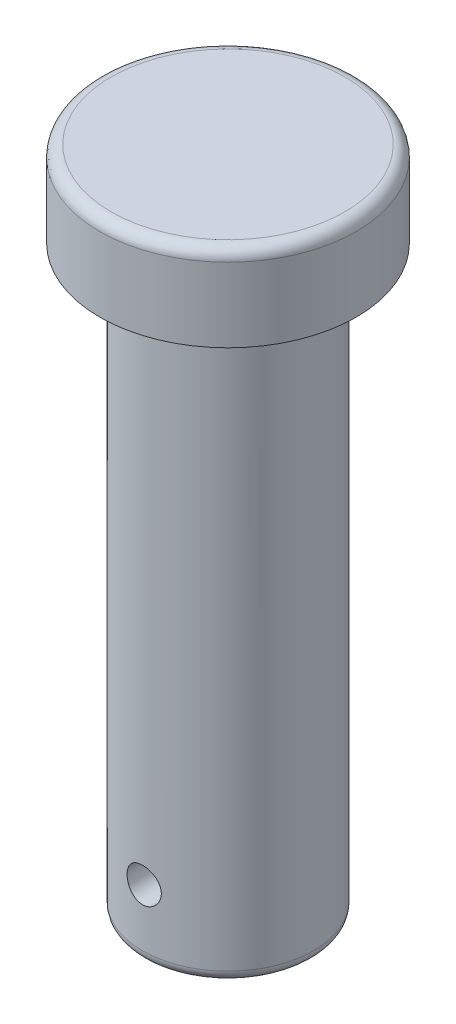
ISO-10303-21;
HEADER;
FILE_DESCRIPTION(('STEP AP214'),'2;1');
FILE_NAME('part.step','',(''),(''),'','','');
FILE_SCHEMA(('AUTOMOTIVE_DESIGN { 1 0 10303 214 1 1 1 1 }'));
ENDSEC;
DATA;
#1=APPLICATION_CONTEXT('core data for automotive mechanical design processes');
#2=APPLICATION_PROTOCOL_DEFINITION('international standard','automotive_design',2000,#1);
#3=PRODUCT_CONTEXT('',#1,'mechanical');
#4=PRODUCT('Part','Part','',(#3));
#5=PRODUCT_RELATED_PRODUCT_CATEGORY('part','',(#4));
#6=PRODUCT_DEFINITION_FORMATION('','',#4);
#7=PRODUCT_DEFINITION_CONTEXT('part definition',#1,'design');
#8=PRODUCT_DEFINITION('design','',#6,#7);
#9=PRODUCT_DEFINITION_SHAPE('','',#8);
#10=(LENGTH_UNIT() NAMED_UNIT(*) SI_UNIT(.MILLI.,.METRE.));
#11=(NAMED_UNIT(*) PLANE_ANGLE_UNIT() SI_UNIT($,.RADIAN.));
#12=(NAMED_UNIT(*) SI_UNIT($,.STERADIAN.) SOLID_ANGLE_UNIT());
#13=UNCERTAINTY_MEASURE_WITH_UNIT(LENGTH_MEASURE(1.E-05),#10,'distance_accuracy_value','');
#14=(GEOMETRIC_REPRESENTATION_CONTEXT(3) GLOBAL_UNCERTAINTY_ASSIGNED_CONTEXT((#13)) GLOBAL_UNIT_ASSIGNED_CONTEXT((#10,
#11,#12)) REPRESENTATION_CONTEXT('',''));
#15=CARTESIAN_POINT('',(0.,0.,0.));
#16=DIRECTION('',(0.,0.,1.));
#17=DIRECTION('',(1.,0.,0.));
#18=AXIS2_PLACEMENT_3D('',#15,#16,#17);
#19=CARTESIAN_POINT('',(0.,15.,0.));
#20=DIRECTION('',(0.,-1.,0.));
#21=DIRECTION('',(0.,0.,-1.));
#22=AXIS2_PLACEMENT_3D('',#19,#20,#21);
#23=CYLINDRICAL_SURFACE('',#22,22.5);
#24=CARTESIAN_POINT('',(0.,13.,0.));
#25=DIRECTION('',(0.,1.,0.));
#26=DIRECTION('',(0.,0.,1.));
#27=AXIS2_PLACEMENT_3D('',#24,#25,#26);
#28=CIRCLE('',#27,22.5);
#29=CARTESIAN_POINT('',(0.,13.,22.5));
#30=VERTEX_POINT('',#29);
#31=EDGE_CURVE('E46',#30,#30,#28,.F.);
#32=ORIENTED_EDGE('',*,*,#31,.T.);
#33=EDGE_LOOP('',(#32));
#34=FACE_BOUND('',#33,.T.);
#35=CARTESIAN_POINT('',(0.,0.,0.));
#36=DIRECTION('',(0.,1.,0.));
#37=DIRECTION('',(0.,0.,1.));
#38=AXIS2_PLACEMENT_3D('',#35,#36,#37);
#39=CIRCLE('',#38,22.5);
#40=CARTESIAN_POINT('',(0.,0.,22.5));
#41=VERTEX_POINT('',#40);
#42=EDGE_CURVE('E111',#41,#41,#39,.T.);
#43=ORIENTED_EDGE('',*,*,#42,.T.);
#44=EDGE_LOOP('',(#43));
#45=FACE_BOUND('',#44,.T.);
#46=ADVANCED_FACE('F33',(#34,#45),#23,.T.);
#47=CARTESIAN_POINT('',(0.,15.,0.));
#48=DIRECTION('',(0.,1.,0.));
#49=DIRECTION('',(0.,0.,1.));
#50=AXIS2_PLACEMENT_3D('',#47,#48,#49);
#51=PLANE('',#50);
#52=CARTESIAN_POINT('',(0.,15.,0.));
#53=DIRECTION('',(0.,1.,0.));
#54=DIRECTION('',(0.,0.,1.));
#55=AXIS2_PLACEMENT_3D('',#52,#53,#54);
#56=CIRCLE('',#55,20.5);
#57=CARTESIAN_POINT('',(0.,15.,20.5));
#58=VERTEX_POINT('',#57);
#59=EDGE_CURVE('E51',#58,#58,#56,.T.);
#60=ORIENTED_EDGE('',*,*,#59,.T.);
#61=EDGE_LOOP('',(#60));
#62=FACE_BOUND('',#61,.T.);
#63=ADVANCED_FACE('F83',(#62),#51,.T.);
#64=CARTESIAN_POINT('',(0.,0.,0.));
#65=DIRECTION('',(0.,1.,0.));
#66=DIRECTION('',(0.,0.,1.));
#67=AXIS2_PLACEMENT_3D('',#64,#65,#66);
#68=PLANE('',#67);
#69=CARTESIAN_POINT('',(0.,0.,0.));
#70=DIRECTION('',(0.,1.,0.));
#71=DIRECTION('',(0.,0.,1.));
#72=AXIS2_PLACEMENT_3D('',#69,#70,#71);
#73=CIRCLE('',#72,17.);
#74=CARTESIAN_POINT('',(0.,0.,17.));
#75=VERTEX_POINT('',#74);
#76=EDGE_CURVE('E10',#75,#75,#73,.T.);
#77=ORIENTED_EDGE('',*,*,#76,.T.);
#78=EDGE_LOOP('',(#77));
#79=FACE_BOUND('',#78,.T.);
#80=ORIENTED_EDGE('',*,*,#42,.F.);
#81=EDGE_LOOP('',(#80));
#82=FACE_BOUND('',#81,.T.);
#83=ADVANCED_FACE('F79',(#79,#82),#68,.F.);
#84=CARTESIAN_POINT('',(0.,-102.,0.));
#85=DIRECTION('',(0.,1.,0.));
#86=DIRECTION('',(0.,0.,1.));
#87=AXIS2_PLACEMENT_3D('',#84,#85,#86);
#88=CYLINDRICAL_SURFACE('',#87,15.);
#89=CARTESIAN_POINT('',(0.,-93.,15.));
#90=CARTESIAN_POINT('',(-0.1667307203779,-92.999993866505,14.9999969274261));
#91=CARTESIAN_POINT('',(-0.333538980604568,-92.9860534710971,14.9971915553469));
#92=CARTESIAN_POINT('',(-0.66244052306706,-92.9307044996543,14.9862709686969));
#93=CARTESIAN_POINT('',(-0.824529952624069,-92.8892741015955,14.9781515358056));
#94=CARTESIAN_POINT('',(-1.13919091578994,-92.7802761791376,14.9575094783486));
#95=CARTESIAN_POINT('',(-1.2917714037994,-92.7127336894659,14.9449910723015));
#96=CARTESIAN_POINT('',(-1.58342396659268,-92.5535032574661,14.9169119410594));
#97=CARTESIAN_POINT('',(-1.72249684522744,-92.4618167531784,14.9013513970712));
#98=CARTESIAN_POINT('',(-1.9850804319446,-92.2555845171257,14.8686649598991));
#99=CARTESIAN_POINT('',(-2.10838185347557,-92.1407749338264,14.8515223651304));
#100=CARTESIAN_POINT('',(-2.33411026982408,-91.8921227508249,14.8177254135776));
#101=CARTESIAN_POINT('',(-2.43653563431127,-91.7582786659947,14.8010710950127));
#102=CARTESIAN_POINT('',(-2.61849526004286,-91.4738514209644,14.7699732543785));
#103=CARTESIAN_POINT('',(-2.6978128165976,-91.3231270686109,14.7555512209484));
#104=CARTESIAN_POINT('',(-2.82991699974093,-91.0101545429878,14.7307880417525));
#105=CARTESIAN_POINT('',(-2.88270624731171,-90.8479075099609,14.7204464928588));
#106=CARTESIAN_POINT('',(-2.95957589965448,-90.5187469082762,14.7051841575661));
#107=CARTESIAN_POINT('',(-2.98402349387633,-90.3519223675733,14.7001941032156));
#108=CARTESIAN_POINT('',(-3.00465638317836,-90.016470535907,14.6959912518188));
#109=CARTESIAN_POINT('',(-3.0008445681405,-89.8478434310396,14.6967778640352));
#110=CARTESIAN_POINT('',(-2.96536371930546,-89.516259635937,14.7039765344455));
#111=CARTESIAN_POINT('',(-2.93411562073172,-89.3532557831181,14.7103035857629));
#112=CARTESIAN_POINT('',(-2.84531365386916,-89.034851770011,14.7277363848));
#113=CARTESIAN_POINT('',(-2.78775852930205,-88.879451973243,14.7388423607334));
#114=CARTESIAN_POINT('',(-2.64757435102416,-88.5794542148892,14.7646685550122));
#115=CARTESIAN_POINT('',(-2.56477845369635,-88.4349363612925,14.7794126944111));
#116=CARTESIAN_POINT('',(-2.37658072371804,-88.1616874500816,14.8108385631919));
#117=CARTESIAN_POINT('',(-2.27117629307049,-88.0329582094465,14.827520515151));
#118=CARTESIAN_POINT('',(-2.03849980368176,-87.7925117926292,14.8613106372439));
#119=CARTESIAN_POINT('',(-1.91086848363734,-87.6811422964226,14.8784210763271));
#120=CARTESIAN_POINT('',(-1.63855507218603,-87.4813384610963,14.9108654614323));
#121=CARTESIAN_POINT('',(-1.49387276213816,-87.3929044161193,14.9261993846692));
#122=CARTESIAN_POINT('',(-1.19117816063676,-87.2414174723221,14.9534007048266));
#123=CARTESIAN_POINT('',(-1.0331454587559,-87.1784043190664,14.9652626654482));
#124=CARTESIAN_POINT('',(-0.708446929345994,-87.0799185778843,14.9841422696357));
#125=CARTESIAN_POINT('',(-0.541782150217348,-87.0444426537791,14.9911605000159));
#126=CARTESIAN_POINT('',(-0.20753821688145,-87.0025306386172,14.999480156006));
#127=CARTESIAN_POINT('',(-0.0400209849767272,-86.9956187413792,15.0008752395741));
#128=CARTESIAN_POINT('',(0.293774802578145,-87.0097495768265,14.9980515579031));
#129=CARTESIAN_POINT('',(0.460053427331383,-87.0307907380578,14.9938331082434));
#130=CARTESIAN_POINT('',(0.785116979839625,-87.0998351206319,14.9803149602405));
#131=CARTESIAN_POINT('',(0.94395584501971,-87.1475942054937,14.9710612921262));
#132=CARTESIAN_POINT('',(1.251370882499,-87.2684519479674,14.948506561831));
#133=CARTESIAN_POINT('',(1.39994628491262,-87.3415525040305,14.9352051964268));
#134=CARTESIAN_POINT('',(1.68462352105866,-87.5120474719539,14.9057973459988));
#135=CARTESIAN_POINT('',(1.82055038025656,-87.6097283431168,14.8896585131116));
#136=CARTESIAN_POINT('',(2.07425405735762,-87.8262275736218,14.8564420448965));
#137=CARTESIAN_POINT('',(2.19202892679229,-87.9450481991996,14.8393643090516));
#138=CARTESIAN_POINT('',(2.40792177232253,-88.2026200556734,14.8058791067089));
#139=CARTESIAN_POINT('',(2.50571310734597,-88.341647232664,14.7894858069991));
#140=CARTESIAN_POINT('',(2.67655626015362,-88.63443408407,14.7595257538858));
#141=CARTESIAN_POINT('',(2.74960906776871,-88.7881931687207,14.7459588874003));
#142=CARTESIAN_POINT('',(2.86845552474589,-89.1053047384487,14.7233022175315));
#143=CARTESIAN_POINT('',(2.91439049937316,-89.268602523631,14.7141892461656));
#144=CARTESIAN_POINT('',(2.97812595488159,-89.6008003604727,14.7014231037608));
#145=CARTESIAN_POINT('',(2.99593010467534,-89.7696996786281,14.6977692207333));
#146=CARTESIAN_POINT('',(3.00276273260241,-90.105026593633,14.6963744889414));
#147=CARTESIAN_POINT('',(2.99230736421269,-90.271443446781,14.698527575679));
#148=CARTESIAN_POINT('',(2.94405691230018,-90.6000949497151,14.7082672045384));
#149=CARTESIAN_POINT('',(2.90626204838789,-90.7623296330844,14.7158537030151));
#150=CARTESIAN_POINT('',(2.80463570549686,-91.0776831337216,14.7355579265748));
#151=CARTESIAN_POINT('',(2.74086752015203,-91.2308230815073,14.7476646305649));
#152=CARTESIAN_POINT('',(2.58916393380481,-91.5243111622033,14.7750514492251));
#153=CARTESIAN_POINT('',(2.50122650632465,-91.6646582211754,14.7903318299668));
#154=CARTESIAN_POINT('',(2.30191774435925,-91.9311467164509,14.8226688156968));
#155=CARTESIAN_POINT('',(2.19017366170555,-92.0570062958028,14.839751187291));
#156=CARTESIAN_POINT('',(1.94719310703942,-92.2883586165875,14.8735824561586));
#157=CARTESIAN_POINT('',(1.81595216146,-92.3938466709518,14.8903312758955));
#158=CARTESIAN_POINT('',(1.53605288726473,-92.5825039318393,14.9218149716391));
#159=CARTESIAN_POINT('',(1.3872266532895,-92.6654280098401,14.9365269365774));
#160=CARTESIAN_POINT('',(1.0774990828222,-92.8049583677898,14.96205375255));
#161=CARTESIAN_POINT('',(0.91660878258938,-92.8615883685975,14.9728721141585));
#162=CARTESIAN_POINT('',(0.629464466771342,-92.9359558441341,14.9872911778611));
#163=CARTESIAN_POINT('',(0.504844992041359,-92.9599295811233,14.9920290947536));
#164=CARTESIAN_POINT('',(0.253498575630205,-92.9919537370751,14.9983846241968));
#165=CARTESIAN_POINT('',(0.126771701245859,-93.0000046635293,15.0000023361946));
#166=CARTESIAN_POINT('',(0.,-93.,15.));
#167=B_SPLINE_CURVE_WITH_KNOTS('',3,(#89,#90,#91,#92,#93,#94,#95,#96,#97,#98,#99,#100,#101,#102,
#103,#104,#105,#106,#107,#108,#109,#110,#111,#112,#113,#114,#115,#116,#117,#118,#119,#120,#121,
#122,#123,#124,#125,#126,#127,#128,#129,#130,#131,#132,#133,#134,#135,#136,#137,#138,#139,#140,
#141,#142,#143,#144,#145,#146,#147,#148,#149,#150,#151,#152,#153,#154,#155,#156,#157,#158,#159,
#160,#161,#162,#163,#164,#165,#166),.UNSPECIFIED.,.T.,.F.,(4,2,2,2,2,2,2,2,2,2,2,2,2,2,2,2,2,2,
2,2,2,2,2,2,2,2,2,2,2,2,2,2,2,2,2,2,2,2,4),(0.,0.499728391983777,0.999853952073972,
1.49950120575102,1.9991187066926,2.50479801033655,3.0105167902421,3.52083585017769,
4.03110448095593,4.53468555310762,5.03821512843675,5.53415181018835,6.0301121776119,
6.52942470610777,7.02879464249011,7.53714757474053,8.04550702619462,8.55465824562072,
9.06374777094109,9.56432207028796,10.064868229736,10.5609136185217,11.0569961764807,
11.5591519810008,12.0613616503779,12.5712188573768,13.081055661704,13.5882114309817,
14.0953010499125,14.5931916770311,15.0910783047783,15.5877588375933,16.084481027456,
16.5896422871743,17.0949196359879,17.6054849002691,18.1155886655256,18.4955632586968,
18.8755257411299),.UNSPECIFIED.);
#168=CARTESIAN_POINT('',(0.,-93.,15.));
#169=VERTEX_POINT('',#168);
#170=EDGE_CURVE('E37',#169,#169,#167,.T.);
#171=ORIENTED_EDGE('',*,*,#170,.T.);
#172=EDGE_LOOP('',(#171));
#173=FACE_BOUND('',#172,.T.);
#174=CARTESIAN_POINT('',(3.,-90.,-14.6969384566991));
#175=CARTESIAN_POINT('',(2.99999383762582,-89.8333068735265,-14.6969417707994));
#176=CARTESIAN_POINT('',(2.98605951515444,-89.66653613,-14.6998052480611));
#177=CARTESIAN_POINT('',(2.93073685074853,-89.3377124845706,-14.7109329391462));
#178=CARTESIAN_POINT('',(2.88932654121148,-89.1756634660921,-14.7192014743436));
#179=CARTESIAN_POINT('',(2.78038734785924,-88.8610880899374,-14.7401662116556));
#180=CARTESIAN_POINT('',(2.71288444245787,-88.7085524354022,-14.7528580086323));
#181=CARTESIAN_POINT('',(2.55374732301152,-88.4169754659091,-14.7812339844198));
#182=CARTESIAN_POINT('',(2.46211445580346,-88.2779333983863,-14.7969179962038));
#183=CARTESIAN_POINT('',(2.25593722696031,-88.0153169884384,-14.8297589908276));
#184=CARTESIAN_POINT('',(2.14111696773996,-87.8919612363481,-14.8469321351174));
#185=CARTESIAN_POINT('',(1.89242036706393,-87.6661273992631,-14.880674169078));
#186=CARTESIAN_POINT('',(1.75854269093396,-87.5636507777484,-14.8972430163249));
#187=CARTESIAN_POINT('',(1.47408406777277,-87.3816359471146,-14.9280838925269));
#188=CARTESIAN_POINT('',(1.32336770301664,-87.3023054585501,-14.9423346432465));
#189=CARTESIAN_POINT('',(1.01041245116182,-87.1701751888556,-14.9667521065089));
#190=CARTESIAN_POINT('',(0.848174644261662,-87.117372924297,-14.9769192013236));
#191=CARTESIAN_POINT('',(0.519050319835487,-87.0404784191411,-14.9919096206526));
#192=CARTESIAN_POINT('',(0.352253217644447,-87.016017067287,-14.9968015886438));
#193=CARTESIAN_POINT('',(0.0168557053126149,-86.9953471444851,-15.0009276355081));
#194=CARTESIAN_POINT('',(-0.151744529495524,-86.9991358510625,-15.0001622595828));
#195=CARTESIAN_POINT('',(-0.48342600223076,-87.0345785406467,-14.9931130460555));
#196=CARTESIAN_POINT('',(-0.646551642895403,-87.0658349315035,-14.9869079509751));
#197=CARTESIAN_POINT('',(-0.965194879740896,-87.1546950973767,-14.9697653147823));
#198=CARTESIAN_POINT('',(-1.12071217124138,-87.2122999265756,-14.9588275843212));
#199=CARTESIAN_POINT('',(-1.42085838960266,-87.3525901204418,-14.9333188805988));
#200=CARTESIAN_POINT('',(-1.56541252240169,-87.4354312533147,-14.9187254452567));
#201=CARTESIAN_POINT('',(-1.83871513757926,-87.6237272317098,-14.8875140842136));
#202=CARTESIAN_POINT('',(-1.967461798575,-87.7291846793115,-14.8708959256567));
#203=CARTESIAN_POINT('',(-2.20785429316037,-87.9619008663254,-14.8371289309338));
#204=CARTESIAN_POINT('',(-2.31916294972089,-88.0895075601888,-14.8199758937255));
#205=CARTESIAN_POINT('',(-2.51885547953042,-88.3617493273523,-14.7873471479628));
#206=CARTESIAN_POINT('',(-2.60723891918325,-88.5063847226496,-14.7718714711364));
#207=CARTESIAN_POINT('',(-2.75868844440565,-88.8090624954654,-14.7443414241877));
#208=CARTESIAN_POINT('',(-2.82169994333313,-88.967132902919,-14.7322944469065));
#209=CARTESIAN_POINT('',(-2.92017102488275,-89.291913971172,-14.7130942896382));
#210=CARTESIAN_POINT('',(-2.95563419836993,-89.4586235028572,-14.7059404718528));
#211=CARTESIAN_POINT('',(-2.99749801810815,-89.7928945739971,-14.6974643780348));
#212=CARTESIAN_POINT('',(-3.00438557669374,-89.960392722931,-14.6960444117146));
#213=CARTESIAN_POINT('',(-2.99021288493222,-90.294144669599,-14.6989345706656));
#214=CARTESIAN_POINT('',(-2.96915421936733,-90.4603985373566,-14.7032443710116));
#215=CARTESIAN_POINT('',(-2.90010662422247,-90.7853059208767,-14.7170169748474));
#216=CARTESIAN_POINT('',(-2.8523778625179,-90.9440170291073,-14.7264299704349));
#217=CARTESIAN_POINT('',(-2.73162310592556,-91.2511898370862,-14.7493046805499));
#218=CARTESIAN_POINT('',(-2.65859502711954,-91.3996506913071,-14.7627667285881));
#219=CARTESIAN_POINT('',(-2.4882124266468,-91.6842393298505,-14.7924421788612));
#220=CARTESIAN_POINT('',(-2.39055323394827,-91.8201811389025,-14.8086891559471));
#221=CARTESIAN_POINT('',(-2.17408671663814,-92.0739249360027,-14.8420117147991));
#222=CARTESIAN_POINT('',(-2.05527721543362,-92.1917250547477,-14.8590873817145));
#223=CARTESIAN_POINT('',(-1.79769682049368,-92.4076876775567,-14.8924603760765));
#224=CARTESIAN_POINT('',(-1.6586474967889,-92.50552096395,-14.9087417312605));
#225=CARTESIAN_POINT('',(-1.36580368990427,-92.6764376444987,-14.9384138288586));
#226=CARTESIAN_POINT('',(-1.21200982630053,-92.7495220780343,-14.9518046926563));
#227=CARTESIAN_POINT('',(-0.894908042472047,-92.8683866152399,-14.974118821832));
#228=CARTESIAN_POINT('',(-0.731660020434244,-92.9143215546788,-14.9830673742781));
#229=CARTESIAN_POINT('',(-0.399568364039744,-92.9780737429915,-14.9955970781298));
#230=CARTESIAN_POINT('',(-0.230725406133645,-92.995894378427,-14.9991788759955));
#231=CARTESIAN_POINT('',(0.104618681710853,-93.0027809428887,-15.0005562136234));
#232=CARTESIAN_POINT('',(0.271109436424471,-92.9923418413687,-14.9984513564799));
#233=CARTESIAN_POINT('',(0.59991309394694,-92.9440981483565,-14.9889013068102));
#234=CARTESIAN_POINT('',(0.762226049261159,-92.9062939009556,-14.9814561814329));
#235=CARTESIAN_POINT('',(1.07775824923519,-92.8046130237252,-14.9620649509476));
#236=CARTESIAN_POINT('',(1.23099732972048,-92.7407958656071,-14.9501291174284));
#237=CARTESIAN_POINT('',(1.5246636605582,-92.5889632760067,-14.9230416637104));
#238=CARTESIAN_POINT('',(1.66508989730353,-92.5009459322865,-14.9078897894096));
#239=CARTESIAN_POINT('',(1.93159167031774,-92.3015418388161,-14.8757279747022));
#240=CARTESIAN_POINT('',(2.05739914834452,-92.1898009908487,-14.858692002537));
#241=CARTESIAN_POINT('',(2.28864785327551,-91.9468492797037,-14.8248366872359));
#242=CARTESIAN_POINT('',(2.39408424962674,-91.8156338115602,-14.8080173963616));
#243=CARTESIAN_POINT('',(2.58267665834994,-91.5357620499287,-14.7763002820179));
#244=CARTESIAN_POINT('',(2.66558044385427,-91.3869331166362,-14.7614251071368));
#245=CARTESIAN_POINT('',(2.80507214779868,-91.0772016802197,-14.7355571137924));
#246=CARTESIAN_POINT('',(2.86168393792249,-90.9163102839384,-14.7245607757495));
#247=CARTESIAN_POINT('',(2.93600741957297,-90.6292126336714,-14.7098904341353));
#248=CARTESIAN_POINT('',(2.95996169557105,-90.5046437414581,-14.7050635474382));
#249=CARTESIAN_POINT('',(2.99196005387913,-90.2533981363466,-14.6985863537725));
#250=CARTESIAN_POINT('',(3.00000468468793,-90.1267214962666,-14.6969359372925));
#251=CARTESIAN_POINT('',(3.,-90.,-14.6969384566991));
#252=B_SPLINE_CURVE_WITH_KNOTS('',3,(#174,#175,#176,#177,#178,#179,#180,#181,#182,#183,#184,
#185,#186,#187,#188,#189,#190,#191,#192,#193,#194,#195,#196,#197,#198,#199,#200,#201,#202,#203,
#204,#205,#206,#207,#208,#209,#210,#211,#212,#213,#214,#215,#216,#217,#218,#219,#220,#221,#222,
#223,#224,#225,#226,#227,#228,#229,#230,#231,#232,#233,#234,#235,#236,#237,#238,#239,#240,#241,
#242,#243,#244,#245,#246,#247,#248,#249,#250,#251),.UNSPECIFIED.,.T.,.F.,(4,2,2,2,2,2,2,2,2,2,2,
2,2,2,2,2,2,2,2,2,2,2,2,2,2,2,2,2,2,2,2,2,2,2,2,2,2,2,4),(0.,0.499615391608283,
0.999630717852883,1.49914949382175,1.99864039457959,2.5044675764531,3.01033020106266,
3.5206020131235,4.03082604739679,4.53432746649241,5.03778036348745,5.53406368900612,
6.0303668722125,6.52979772666909,7.02928607310198,7.5374804028745,8.04568434368161,
8.55497589518331,9.06420105048074,9.5647127341378,10.0651960358526,10.5608802534996,
11.0566053106319,11.5587917932356,12.0610299861063,12.5709780520035,13.0809046989031,
13.5878944073595,14.0948230407488,14.5929305224406,15.0910317410027,15.5880005122635,
16.0850085640405,16.5900345607679,17.0951801666934,17.6057669573882,18.1158892527059,
18.4957141091448,18.8755258705644),.UNSPECIFIED.);
#253=CARTESIAN_POINT('',(3.,-90.,-14.6969384566991));
#254=VERTEX_POINT('',#253);
#255=EDGE_CURVE('E54',#254,#254,#252,.T.);
#256=ORIENTED_EDGE('',*,*,#255,.T.);
#257=EDGE_LOOP('',(#256));
#258=FACE_BOUND('',#257,.T.);
#259=CARTESIAN_POINT('',(0.,-100.,0.));
#260=DIRECTION('',(0.,-1.,0.));
#261=DIRECTION('',(0.,0.,-1.));
#262=AXIS2_PLACEMENT_3D('',#259,#260,#261);
#263=CIRCLE('',#262,15.);
#264=CARTESIAN_POINT('',(0.,-100.,-15.));
#265=VERTEX_POINT('',#264);
#266=EDGE_CURVE('E102',#265,#265,#263,.F.);
#267=ORIENTED_EDGE('',*,*,#266,.T.);
#268=EDGE_LOOP('',(#267));
#269=FACE_BOUND('',#268,.T.);
#270=CARTESIAN_POINT('',(0.,-2.,0.));
#271=DIRECTION('',(0.,1.,0.));
#272=DIRECTION('',(0.,0.,1.));
#273=AXIS2_PLACEMENT_3D('',#270,#271,#272);
#274=CIRCLE('',#273,15.);
#275=CARTESIAN_POINT('',(0.,-2.,15.));
#276=VERTEX_POINT('',#275);
#277=EDGE_CURVE('E104',#276,#276,#274,.F.);
#278=ORIENTED_EDGE('',*,*,#277,.T.);
#279=EDGE_LOOP('',(#278));
#280=FACE_BOUND('',#279,.T.);
#281=ADVANCED_FACE('F59',(#173,#258,#269,#280),#88,.T.);
#282=CARTESIAN_POINT('',(0.,-102.,0.));
#283=DIRECTION('',(0.,-1.,0.));
#284=DIRECTION('',(0.,0.,-1.));
#285=AXIS2_PLACEMENT_3D('',#282,#283,#284);
#286=PLANE('',#285);
#287=CARTESIAN_POINT('',(0.,-102.,0.));
#288=DIRECTION('',(0.,-1.,0.));
#289=DIRECTION('',(0.,0.,-1.));
#290=AXIS2_PLACEMENT_3D('',#287,#288,#289);
#291=CIRCLE('',#290,13.);
#292=CARTESIAN_POINT('',(0.,-102.,-13.));
#293=VERTEX_POINT('',#292);
#294=EDGE_CURVE('E109',#293,#293,#291,.T.);
#295=ORIENTED_EDGE('',*,*,#294,.T.);
#296=EDGE_LOOP('',(#295));
#297=FACE_BOUND('',#296,.T.);
#298=ADVANCED_FACE('F67',(#297),#286,.T.);
#299=CARTESIAN_POINT('',(0.,-100.,0.));
#300=DIRECTION('',(0.,-1.,0.));
#301=DIRECTION('',(0.,0.,-1.));
#302=AXIS2_PLACEMENT_3D('',#299,#300,#301);
#303=TOROIDAL_SURFACE('',#302,13.,2.);
#304=ORIENTED_EDGE('',*,*,#266,.F.);
#305=EDGE_LOOP('',(#304));
#306=FACE_BOUND('',#305,.T.);
#307=ORIENTED_EDGE('',*,*,#294,.F.);
#308=EDGE_LOOP('',(#307));
#309=FACE_BOUND('',#308,.T.);
#310=ADVANCED_FACE('F70',(#306,#309),#303,.T.);
#311=CARTESIAN_POINT('',(0.,13.,0.));
#312=DIRECTION('',(0.,1.,0.));
#313=DIRECTION('',(0.,0.,1.));
#314=AXIS2_PLACEMENT_3D('',#311,#312,#313);
#315=TOROIDAL_SURFACE('',#314,20.5,2.);
#316=ORIENTED_EDGE('',*,*,#31,.F.);
#317=EDGE_LOOP('',(#316));
#318=FACE_BOUND('',#317,.T.);
#319=ORIENTED_EDGE('',*,*,#59,.F.);
#320=EDGE_LOOP('',(#319));
#321=FACE_BOUND('',#320,.T.);
#322=ADVANCED_FACE('F76',(#318,#321),#315,.T.);
#323=CARTESIAN_POINT('',(0.,-2.,0.));
#324=DIRECTION('',(0.,1.,0.));
#325=DIRECTION('',(0.,0.,1.));
#326=AXIS2_PLACEMENT_3D('',#323,#324,#325);
#327=TOROIDAL_SURFACE('',#326,17.,2.);
#328=ORIENTED_EDGE('',*,*,#76,.F.);
#329=EDGE_LOOP('',(#328));
#330=FACE_BOUND('',#329,.T.);
#331=ORIENTED_EDGE('',*,*,#277,.F.);
#332=EDGE_LOOP('',(#331));
#333=FACE_BOUND('',#332,.T.);
#334=ADVANCED_FACE('F35',(#330,#333),#327,.F.);
#335=CARTESIAN_POINT('',(0.,-90.,-22.5));
#336=DIRECTION('',(0.,0.,1.));
#337=DIRECTION('',(1.,0.,0.));
#338=AXIS2_PLACEMENT_3D('',#335,#336,#337);
#339=CYLINDRICAL_SURFACE('',#338,3.);
#340=ORIENTED_EDGE('',*,*,#255,.F.);
#341=EDGE_LOOP('',(#340));
#342=FACE_BOUND('',#341,.T.);
#343=ORIENTED_EDGE('',*,*,#170,.F.);
#344=EDGE_LOOP('',(#343));
#345=FACE_BOUND('',#344,.T.);
#346=ADVANCED_FACE('F63',(#342,#345),#339,.F.);
#347=CLOSED_SHELL('',(#46,#63,#83,#281,#298,#310,#322,#334,#346));
#348=MANIFOLD_SOLID_BREP('B2',#347);
#349=ADVANCED_BREP_SHAPE_REPRESENTATION('',(#18,#348),#14);
#350=SHAPE_DEFINITION_REPRESENTATION(#9,#349);
ENDSEC;
END-ISO-10303-21;
